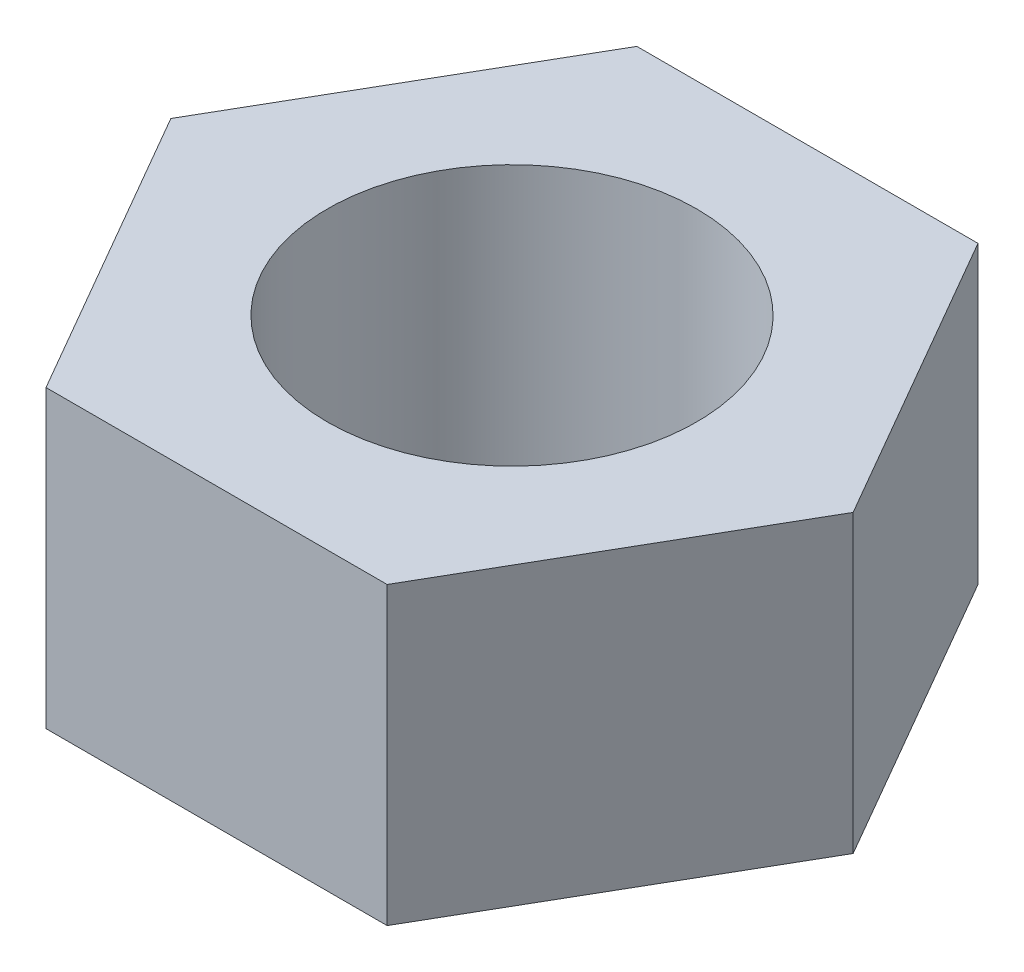
ISO-10303-21;
HEADER;
FILE_DESCRIPTION(('STEP AP214'),'2;1');
FILE_NAME('part.step','',(''),(''),'','','');
FILE_SCHEMA(('AUTOMOTIVE_DESIGN { 1 0 10303 214 1 1 1 1 }'));
ENDSEC;
DATA;
#1=APPLICATION_CONTEXT('core data for automotive mechanical design processes');
#2=APPLICATION_PROTOCOL_DEFINITION('international standard','automotive_design',2000,#1);
#3=PRODUCT_CONTEXT('',#1,'mechanical');
#4=PRODUCT('Part','Part','',(#3));
#5=PRODUCT_RELATED_PRODUCT_CATEGORY('part','',(#4));
#6=PRODUCT_DEFINITION_FORMATION('','',#4);
#7=PRODUCT_DEFINITION_CONTEXT('part definition',#1,'design');
#8=PRODUCT_DEFINITION('design','',#6,#7);
#9=PRODUCT_DEFINITION_SHAPE('','',#8);
#10=(LENGTH_UNIT() NAMED_UNIT(*) SI_UNIT(.MILLI.,.METRE.));
#11=(NAMED_UNIT(*) PLANE_ANGLE_UNIT() SI_UNIT($,.RADIAN.));
#12=(NAMED_UNIT(*) SI_UNIT($,.STERADIAN.) SOLID_ANGLE_UNIT());
#13=UNCERTAINTY_MEASURE_WITH_UNIT(LENGTH_MEASURE(1.E-05),#10,'distance_accuracy_value','');
#14=(GEOMETRIC_REPRESENTATION_CONTEXT(3) GLOBAL_UNCERTAINTY_ASSIGNED_CONTEXT((#13)) GLOBAL_UNIT_ASSIGNED_CONTEXT((#10,
#11,#12)) REPRESENTATION_CONTEXT('',''));
#15=CARTESIAN_POINT('',(0.,0.,0.));
#16=DIRECTION('',(0.,0.,1.));
#17=DIRECTION('',(1.,0.,0.));
#18=AXIS2_PLACEMENT_3D('',#15,#16,#17);
#19=CARTESIAN_POINT('',(0.,4.,0.));
#20=DIRECTION('',(0.,1.,0.));
#21=DIRECTION('',(0.,0.,1.));
#22=AXIS2_PLACEMENT_3D('',#19,#20,#21);
#23=PLANE('',#22);
#24=DIRECTION('',(-0.5,0.,0.866025403784439));
#25=VECTOR('',#24,1.);
#26=CARTESIAN_POINT('',(-2.3094010767585,4.,-4.));
#27=LINE('',#26,#25);
#28=CARTESIAN_POINT('',(-2.3094010767585,4.,-4.));
#29=VERTEX_POINT('',#28);
#30=CARTESIAN_POINT('',(-4.61880215351701,4.,0.));
#31=VERTEX_POINT('',#30);
#32=EDGE_CURVE('E129',#29,#31,#27,.T.);
#33=ORIENTED_EDGE('',*,*,#32,.T.);
#34=DIRECTION('',(0.5,0.,0.866025403784439));
#35=VECTOR('',#34,1.);
#36=CARTESIAN_POINT('',(-4.61880215351701,4.,0.));
#37=LINE('',#36,#35);
#38=CARTESIAN_POINT('',(-2.3094010767585,4.,4.));
#39=VERTEX_POINT('',#38);
#40=EDGE_CURVE('E87',#31,#39,#37,.T.);
#41=ORIENTED_EDGE('',*,*,#40,.T.);
#42=DIRECTION('',(1.,0.,0.));
#43=VECTOR('',#42,1.);
#44=CARTESIAN_POINT('',(-2.3094010767585,4.,4.));
#45=LINE('',#44,#43);
#46=CARTESIAN_POINT('',(2.3094010767585,4.,4.));
#47=VERTEX_POINT('',#46);
#48=EDGE_CURVE('E100',#39,#47,#45,.T.);
#49=ORIENTED_EDGE('',*,*,#48,.T.);
#50=DIRECTION('',(0.5,0.,-0.866025403784439));
#51=VECTOR('',#50,1.);
#52=CARTESIAN_POINT('',(2.3094010767585,4.,4.));
#53=LINE('',#52,#51);
#54=CARTESIAN_POINT('',(4.61880215351701,4.,0.));
#55=VERTEX_POINT('',#54);
#56=EDGE_CURVE('E94',#47,#55,#53,.T.);
#57=ORIENTED_EDGE('',*,*,#56,.T.);
#58=DIRECTION('',(-0.5,0.,-0.866025403784439));
#59=VECTOR('',#58,1.);
#60=CARTESIAN_POINT('',(4.61880215351701,4.,0.));
#61=LINE('',#60,#59);
#62=CARTESIAN_POINT('',(2.3094010767585,4.,-4.));
#63=VERTEX_POINT('',#62);
#64=EDGE_CURVE('E98',#55,#63,#61,.T.);
#65=ORIENTED_EDGE('',*,*,#64,.T.);
#66=DIRECTION('',(-1.,0.,0.));
#67=VECTOR('',#66,1.);
#68=CARTESIAN_POINT('',(2.3094010767585,4.,-4.));
#69=LINE('',#68,#67);
#70=EDGE_CURVE('E50',#63,#29,#69,.T.);
#71=ORIENTED_EDGE('',*,*,#70,.T.);
#72=EDGE_LOOP('',(#33,#41,#49,#57,#65,#71));
#73=FACE_BOUND('',#72,.T.);
#74=CARTESIAN_POINT('',(0.,4.,0.));
#75=DIRECTION('',(0.,1.,0.));
#76=DIRECTION('',(0.,0.,1.));
#77=AXIS2_PLACEMENT_3D('',#74,#75,#76);
#78=CIRCLE('',#77,2.5);
#79=CARTESIAN_POINT('',(0.,4.,2.5));
#80=VERTEX_POINT('',#79);
#81=EDGE_CURVE('E122',#80,#80,#78,.T.);
#82=ORIENTED_EDGE('',*,*,#81,.F.);
#83=EDGE_LOOP('',(#82));
#84=FACE_BOUND('',#83,.T.);
#85=ADVANCED_FACE('F33',(#73,#84),#23,.T.);
#86=CARTESIAN_POINT('',(0.,0.,0.));
#87=DIRECTION('',(0.,1.,0.));
#88=DIRECTION('',(0.,0.,1.));
#89=AXIS2_PLACEMENT_3D('',#86,#87,#88);
#90=PLANE('',#89);
#91=DIRECTION('',(-0.5,0.,0.866025403784439));
#92=VECTOR('',#91,1.);
#93=CARTESIAN_POINT('',(-2.3094010767585,0.,-4.));
#94=LINE('',#93,#92);
#95=CARTESIAN_POINT('',(-2.3094010767585,0.,-4.));
#96=VERTEX_POINT('',#95);
#97=CARTESIAN_POINT('',(-4.61880215351701,0.,0.));
#98=VERTEX_POINT('',#97);
#99=EDGE_CURVE('E118',#96,#98,#94,.T.);
#100=ORIENTED_EDGE('',*,*,#99,.F.);
#101=DIRECTION('',(-1.,0.,0.));
#102=VECTOR('',#101,1.);
#103=CARTESIAN_POINT('',(2.3094010767585,0.,-4.));
#104=LINE('',#103,#102);
#105=CARTESIAN_POINT('',(2.3094010767585,0.,-4.));
#106=VERTEX_POINT('',#105);
#107=EDGE_CURVE('E79',#106,#96,#104,.T.);
#108=ORIENTED_EDGE('',*,*,#107,.F.);
#109=DIRECTION('',(-0.5,0.,-0.866025403784439));
#110=VECTOR('',#109,1.);
#111=CARTESIAN_POINT('',(4.61880215351701,0.,0.));
#112=LINE('',#111,#110);
#113=CARTESIAN_POINT('',(4.61880215351701,0.,0.));
#114=VERTEX_POINT('',#113);
#115=EDGE_CURVE('E73',#114,#106,#112,.T.);
#116=ORIENTED_EDGE('',*,*,#115,.F.);
#117=DIRECTION('',(0.5,0.,-0.866025403784439));
#118=VECTOR('',#117,1.);
#119=CARTESIAN_POINT('',(2.3094010767585,0.,4.));
#120=LINE('',#119,#118);
#121=CARTESIAN_POINT('',(2.3094010767585,0.,4.));
#122=VERTEX_POINT('',#121);
#123=EDGE_CURVE('E108',#122,#114,#120,.T.);
#124=ORIENTED_EDGE('',*,*,#123,.F.);
#125=DIRECTION('',(1.,0.,0.));
#126=VECTOR('',#125,1.);
#127=CARTESIAN_POINT('',(-2.3094010767585,0.,4.));
#128=LINE('',#127,#126);
#129=CARTESIAN_POINT('',(-2.3094010767585,0.,4.));
#130=VERTEX_POINT('',#129);
#131=EDGE_CURVE('E124',#130,#122,#128,.T.);
#132=ORIENTED_EDGE('',*,*,#131,.F.);
#133=DIRECTION('',(0.5,0.,0.866025403784439));
#134=VECTOR('',#133,1.);
#135=CARTESIAN_POINT('',(-4.61880215351701,0.,0.));
#136=LINE('',#135,#134);
#137=EDGE_CURVE('E121',#98,#130,#136,.T.);
#138=ORIENTED_EDGE('',*,*,#137,.F.);
#139=EDGE_LOOP('',(#100,#108,#116,#124,#132,#138));
#140=FACE_BOUND('',#139,.T.);
#141=CARTESIAN_POINT('',(0.,0.,0.));
#142=DIRECTION('',(0.,1.,0.));
#143=DIRECTION('',(0.,0.,1.));
#144=AXIS2_PLACEMENT_3D('',#141,#142,#143);
#145=CIRCLE('',#144,2.5);
#146=CARTESIAN_POINT('',(0.,0.,2.5));
#147=VERTEX_POINT('',#146);
#148=EDGE_CURVE('E222',#147,#147,#145,.T.);
#149=ORIENTED_EDGE('',*,*,#148,.T.);
#150=EDGE_LOOP('',(#149));
#151=FACE_BOUND('',#150,.T.);
#152=ADVANCED_FACE('F138',(#140,#151),#90,.F.);
#153=CARTESIAN_POINT('',(-2.3094010767585,4.,-4.));
#154=DIRECTION('',(0.866025403784439,0.,0.5));
#155=DIRECTION('',(0.5,0.,-0.866025403784439));
#156=AXIS2_PLACEMENT_3D('',#153,#154,#155);
#157=PLANE('',#156);
#158=ORIENTED_EDGE('',*,*,#99,.T.);
#159=DIRECTION('',(0.,-1.,0.));
#160=VECTOR('',#159,1.);
#161=CARTESIAN_POINT('',(-4.61880215351701,4.,0.));
#162=LINE('',#161,#160);
#163=EDGE_CURVE('E11',#31,#98,#162,.T.);
#164=ORIENTED_EDGE('',*,*,#163,.F.);
#165=ORIENTED_EDGE('',*,*,#32,.F.);
#166=DIRECTION('',(0.,-1.,0.));
#167=VECTOR('',#166,1.);
#168=CARTESIAN_POINT('',(-2.3094010767585,4.,-4.));
#169=LINE('',#168,#167);
#170=EDGE_CURVE('E114',#29,#96,#169,.T.);
#171=ORIENTED_EDGE('',*,*,#170,.T.);
#172=EDGE_LOOP('',(#158,#164,#165,#171));
#173=FACE_BOUND('',#172,.T.);
#174=ADVANCED_FACE('F35',(#173),#157,.F.);
#175=CARTESIAN_POINT('',(-4.61880215351701,4.,0.));
#176=DIRECTION('',(0.866025403784439,0.,-0.5));
#177=DIRECTION('',(-0.5,0.,-0.866025403784439));
#178=AXIS2_PLACEMENT_3D('',#175,#176,#177);
#179=PLANE('',#178);
#180=ORIENTED_EDGE('',*,*,#137,.T.);
#181=DIRECTION('',(0.,-1.,0.));
#182=VECTOR('',#181,1.);
#183=CARTESIAN_POINT('',(-2.3094010767585,4.,4.));
#184=LINE('',#183,#182);
#185=EDGE_CURVE('E42',#39,#130,#184,.T.);
#186=ORIENTED_EDGE('',*,*,#185,.F.);
#187=ORIENTED_EDGE('',*,*,#40,.F.);
#188=ORIENTED_EDGE('',*,*,#163,.T.);
#189=EDGE_LOOP('',(#180,#186,#187,#188));
#190=FACE_BOUND('',#189,.T.);
#191=ADVANCED_FACE('F163',(#190),#179,.F.);
#192=CARTESIAN_POINT('',(-2.3094010767585,4.,4.));
#193=DIRECTION('',(0.,0.,-1.));
#194=DIRECTION('',(-1.,0.,0.));
#195=AXIS2_PLACEMENT_3D('',#192,#193,#194);
#196=PLANE('',#195);
#197=ORIENTED_EDGE('',*,*,#131,.T.);
#198=DIRECTION('',(0.,-1.,0.));
#199=VECTOR('',#198,1.);
#200=CARTESIAN_POINT('',(2.3094010767585,4.,4.));
#201=LINE('',#200,#199);
#202=EDGE_CURVE('E109',#47,#122,#201,.T.);
#203=ORIENTED_EDGE('',*,*,#202,.F.);
#204=ORIENTED_EDGE('',*,*,#48,.F.);
#205=ORIENTED_EDGE('',*,*,#185,.T.);
#206=EDGE_LOOP('',(#197,#203,#204,#205));
#207=FACE_BOUND('',#206,.T.);
#208=ADVANCED_FACE('F135',(#207),#196,.F.);
#209=CARTESIAN_POINT('',(2.3094010767585,4.,4.));
#210=DIRECTION('',(-0.866025403784438,0.,-0.5));
#211=DIRECTION('',(-0.5,0.,0.866025403784439));
#212=AXIS2_PLACEMENT_3D('',#209,#210,#211);
#213=PLANE('',#212);
#214=ORIENTED_EDGE('',*,*,#123,.T.);
#215=DIRECTION('',(0.,-1.,0.));
#216=VECTOR('',#215,1.);
#217=CARTESIAN_POINT('',(4.61880215351701,4.,0.));
#218=LINE('',#217,#216);
#219=EDGE_CURVE('E105',#55,#114,#218,.T.);
#220=ORIENTED_EDGE('',*,*,#219,.F.);
#221=ORIENTED_EDGE('',*,*,#56,.F.);
#222=ORIENTED_EDGE('',*,*,#202,.T.);
#223=EDGE_LOOP('',(#214,#220,#221,#222));
#224=FACE_BOUND('',#223,.T.);
#225=ADVANCED_FACE('F106',(#224),#213,.F.);
#226=CARTESIAN_POINT('',(4.61880215351701,4.,0.));
#227=DIRECTION('',(-0.866025403784439,0.,0.5));
#228=DIRECTION('',(0.5,0.,0.866025403784439));
#229=AXIS2_PLACEMENT_3D('',#226,#227,#228);
#230=PLANE('',#229);
#231=ORIENTED_EDGE('',*,*,#115,.T.);
#232=DIRECTION('',(0.,-1.,0.));
#233=VECTOR('',#232,1.);
#234=CARTESIAN_POINT('',(2.3094010767585,4.,-4.));
#235=LINE('',#234,#233);
#236=EDGE_CURVE('E110',#63,#106,#235,.T.);
#237=ORIENTED_EDGE('',*,*,#236,.F.);
#238=ORIENTED_EDGE('',*,*,#64,.F.);
#239=ORIENTED_EDGE('',*,*,#219,.T.);
#240=EDGE_LOOP('',(#231,#237,#238,#239));
#241=FACE_BOUND('',#240,.T.);
#242=ADVANCED_FACE('F112',(#241),#230,.F.);
#243=CARTESIAN_POINT('',(2.3094010767585,4.,-4.));
#244=DIRECTION('',(0.,0.,1.));
#245=DIRECTION('',(1.,0.,0.));
#246=AXIS2_PLACEMENT_3D('',#243,#244,#245);
#247=PLANE('',#246);
#248=ORIENTED_EDGE('',*,*,#107,.T.);
#249=ORIENTED_EDGE('',*,*,#170,.F.);
#250=ORIENTED_EDGE('',*,*,#70,.F.);
#251=ORIENTED_EDGE('',*,*,#236,.T.);
#252=EDGE_LOOP('',(#248,#249,#250,#251));
#253=FACE_BOUND('',#252,.T.);
#254=ADVANCED_FACE('F143',(#253),#247,.F.);
#255=CARTESIAN_POINT('',(0.,4.,0.));
#256=DIRECTION('',(0.,-1.,0.));
#257=DIRECTION('',(0.,0.,-1.));
#258=AXIS2_PLACEMENT_3D('',#255,#256,#257);
#259=CYLINDRICAL_SURFACE('',#258,2.5);
#260=ORIENTED_EDGE('',*,*,#81,.T.);
#261=EDGE_LOOP('',(#260));
#262=FACE_BOUND('',#261,.T.);
#263=ORIENTED_EDGE('',*,*,#148,.F.);
#264=EDGE_LOOP('',(#263));
#265=FACE_BOUND('',#264,.T.);
#266=ADVANCED_FACE('F145',(#262,#265),#259,.F.);
#267=CLOSED_SHELL('',(#85,#152,#174,#191,#208,#225,#242,#254,#266));
#268=MANIFOLD_SOLID_BREP('B2',#267);
#269=ADVANCED_BREP_SHAPE_REPRESENTATION('',(#18,#268),#14);
#270=SHAPE_DEFINITION_REPRESENTATION(#9,#269);
ENDSEC;
END-ISO-10303-21;
